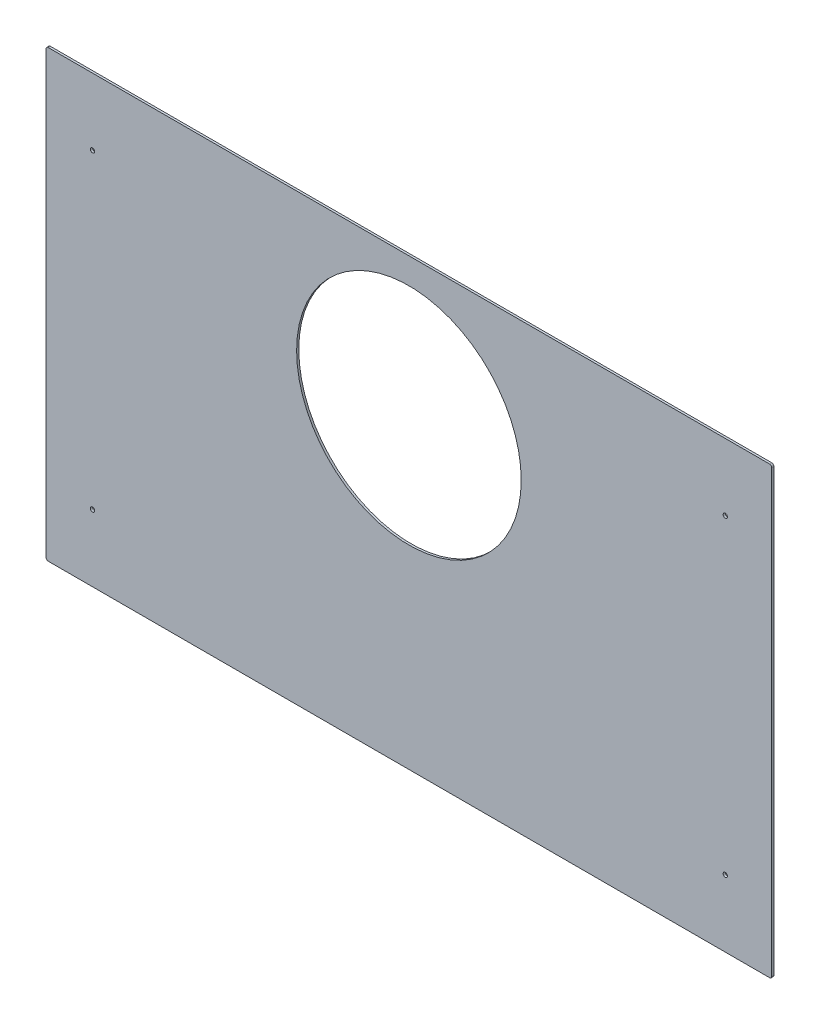
ISO-10303-21;
HEADER;
FILE_DESCRIPTION(('STEP AP214'),'2;1');
FILE_NAME('part.step','',(''),(''),'','','');
FILE_SCHEMA(('AUTOMOTIVE_DESIGN { 1 0 10303 214 1 1 1 1 }'));
ENDSEC;
DATA;
#1=APPLICATION_CONTEXT('core data for automotive mechanical design processes');
#2=APPLICATION_PROTOCOL_DEFINITION('international standard','automotive_design',2000,#1);
#3=PRODUCT_CONTEXT('',#1,'mechanical');
#4=PRODUCT('Part','Part','',(#3));
#5=PRODUCT_RELATED_PRODUCT_CATEGORY('part','',(#4));
#6=PRODUCT_DEFINITION_FORMATION('','',#4);
#7=PRODUCT_DEFINITION_CONTEXT('part definition',#1,'design');
#8=PRODUCT_DEFINITION('design','',#6,#7);
#9=PRODUCT_DEFINITION_SHAPE('','',#8);
#10=(LENGTH_UNIT() NAMED_UNIT(*) SI_UNIT(.MILLI.,.METRE.));
#11=(NAMED_UNIT(*) PLANE_ANGLE_UNIT() SI_UNIT($,.RADIAN.));
#12=(NAMED_UNIT(*) SI_UNIT($,.STERADIAN.) SOLID_ANGLE_UNIT());
#13=UNCERTAINTY_MEASURE_WITH_UNIT(LENGTH_MEASURE(1.E-05),#10,'distance_accuracy_value','');
#14=(GEOMETRIC_REPRESENTATION_CONTEXT(3) GLOBAL_UNCERTAINTY_ASSIGNED_CONTEXT((#13)) GLOBAL_UNIT_ASSIGNED_CONTEXT((#10,
#11,#12)) REPRESENTATION_CONTEXT('',''));
#15=CARTESIAN_POINT('',(0.,0.,0.));
#16=DIRECTION('',(0.,0.,1.));
#17=DIRECTION('',(1.,0.,0.));
#18=AXIS2_PLACEMENT_3D('',#15,#16,#17);
#19=CARTESIAN_POINT('',(0.,0.,3.175));
#20=DIRECTION('',(0.,0.,-1.));
#21=DIRECTION('',(-1.,0.,0.));
#22=AXIS2_PLACEMENT_3D('',#19,#20,#21);
#23=PLANE('',#22);
#24=CARTESIAN_POINT('',(998.5375,555.625,3.175));
#25=DIRECTION('',(0.,0.,-1.));
#26=DIRECTION('',(-1.,0.,0.));
#27=AXIS2_PLACEMENT_3D('',#24,#25,#26);
#28=CIRCLE('',#27,3.17500000000004);
#29=CARTESIAN_POINT('',(995.3625,555.625,3.175));
#30=VERTEX_POINT('',#29);
#31=EDGE_CURVE('E201',#30,#30,#28,.T.);
#32=ORIENTED_EDGE('',*,*,#31,.T.);
#33=EDGE_LOOP('',(#32));
#34=FACE_BOUND('',#33,.T.);
#35=CARTESIAN_POINT('',(998.5375,98.4249999999999,3.175));
#36=DIRECTION('',(0.,0.,-1.));
#37=DIRECTION('',(-1.,0.,0.));
#38=AXIS2_PLACEMENT_3D('',#35,#36,#37);
#39=CIRCLE('',#38,3.17500000000004);
#40=CARTESIAN_POINT('',(995.3625,98.4249999999999,3.175));
#41=VERTEX_POINT('',#40);
#42=EDGE_CURVE('E195',#41,#41,#39,.T.);
#43=ORIENTED_EDGE('',*,*,#42,.T.);
#44=EDGE_LOOP('',(#43));
#45=FACE_BOUND('',#44,.T.);
#46=CARTESIAN_POINT('',(68.2625000000001,98.425,3.175));
#47=DIRECTION('',(0.,0.,-1.));
#48=DIRECTION('',(-1.,0.,0.));
#49=AXIS2_PLACEMENT_3D('',#46,#47,#48);
#50=CIRCLE('',#49,3.175);
#51=CARTESIAN_POINT('',(65.0875000000001,98.425,3.175));
#52=VERTEX_POINT('',#51);
#53=EDGE_CURVE('E189',#52,#52,#50,.T.);
#54=ORIENTED_EDGE('',*,*,#53,.T.);
#55=EDGE_LOOP('',(#54));
#56=FACE_BOUND('',#55,.T.);
#57=CARTESIAN_POINT('',(68.2625000000002,555.625,3.175));
#58=DIRECTION('',(0.,0.,-1.));
#59=DIRECTION('',(-1.,0.,0.));
#60=AXIS2_PLACEMENT_3D('',#57,#58,#59);
#61=CIRCLE('',#60,3.175);
#62=CARTESIAN_POINT('',(65.0875000000002,555.625,3.175));
#63=VERTEX_POINT('',#62);
#64=EDGE_CURVE('E182',#63,#63,#61,.T.);
#65=ORIENTED_EDGE('',*,*,#64,.T.);
#66=EDGE_LOOP('',(#65));
#67=FACE_BOUND('',#66,.T.);
#68=DIRECTION('',(-1.,0.,0.));
#69=VECTOR('',#68,1.);
#70=CARTESIAN_POINT('',(0.,654.05,3.175));
#71=LINE('',#70,#69);
#72=CARTESIAN_POINT('',(1063.625,654.05,3.175));
#73=VERTEX_POINT('',#72);
#74=CARTESIAN_POINT('',(3.175,654.05,3.175));
#75=VERTEX_POINT('',#74);
#76=EDGE_CURVE('E137',#73,#75,#71,.T.);
#77=ORIENTED_EDGE('',*,*,#76,.T.);
#78=CARTESIAN_POINT('',(3.175,650.875,3.175));
#79=DIRECTION('',(0.,0.,-1.));
#80=DIRECTION('',(-1.,0.,0.));
#81=AXIS2_PLACEMENT_3D('',#78,#79,#80);
#82=CIRCLE('',#81,3.175);
#83=CARTESIAN_POINT('',(0.,650.875,3.175));
#84=VERTEX_POINT('',#83);
#85=EDGE_CURVE('E156',#75,#84,#82,.F.);
#86=ORIENTED_EDGE('',*,*,#85,.T.);
#87=DIRECTION('',(0.,-1.,0.));
#88=VECTOR('',#87,1.);
#89=CARTESIAN_POINT('',(0.,0.,3.175));
#90=LINE('',#89,#88);
#91=CARTESIAN_POINT('',(0.,3.175,3.175));
#92=VERTEX_POINT('',#91);
#93=EDGE_CURVE('E120',#84,#92,#90,.T.);
#94=ORIENTED_EDGE('',*,*,#93,.T.);
#95=CARTESIAN_POINT('',(3.175,3.175,3.175));
#96=DIRECTION('',(0.,0.,-1.));
#97=DIRECTION('',(-1.,0.,0.));
#98=AXIS2_PLACEMENT_3D('',#95,#96,#97);
#99=CIRCLE('',#98,3.175);
#100=CARTESIAN_POINT('',(3.175,0.,3.175));
#101=VERTEX_POINT('',#100);
#102=EDGE_CURVE('E154',#92,#101,#99,.F.);
#103=ORIENTED_EDGE('',*,*,#102,.T.);
#104=DIRECTION('',(1.,0.,0.));
#105=VECTOR('',#104,1.);
#106=CARTESIAN_POINT('',(0.,0.,3.175));
#107=LINE('',#106,#105);
#108=CARTESIAN_POINT('',(1063.625,0.,3.175));
#109=VERTEX_POINT('',#108);
#110=EDGE_CURVE('E167',#101,#109,#107,.T.);
#111=ORIENTED_EDGE('',*,*,#110,.T.);
#112=CARTESIAN_POINT('',(1063.625,3.175,3.175));
#113=DIRECTION('',(0.,0.,-1.));
#114=DIRECTION('',(-1.,0.,0.));
#115=AXIS2_PLACEMENT_3D('',#112,#113,#114);
#116=CIRCLE('',#115,3.175);
#117=CARTESIAN_POINT('',(1066.8,3.175,3.175));
#118=VERTEX_POINT('',#117);
#119=EDGE_CURVE('E55',#109,#118,#116,.F.);
#120=ORIENTED_EDGE('',*,*,#119,.T.);
#121=DIRECTION('',(0.,1.,0.));
#122=VECTOR('',#121,1.);
#123=CARTESIAN_POINT('',(1066.8,0.,3.175));
#124=LINE('',#123,#122);
#125=CARTESIAN_POINT('',(1066.8,650.875,3.175));
#126=VERTEX_POINT('',#125);
#127=EDGE_CURVE('E175',#118,#126,#124,.T.);
#128=ORIENTED_EDGE('',*,*,#127,.T.);
#129=CARTESIAN_POINT('',(1063.625,650.875,3.175));
#130=DIRECTION('',(0.,0.,-1.));
#131=DIRECTION('',(-1.,0.,0.));
#132=AXIS2_PLACEMENT_3D('',#129,#130,#131);
#133=CIRCLE('',#132,3.175);
#134=EDGE_CURVE('E151',#126,#73,#133,.F.);
#135=ORIENTED_EDGE('',*,*,#134,.T.);
#136=EDGE_LOOP('',(#77,#86,#94,#103,#111,#120,#128,#135));
#137=FACE_BOUND('',#136,.T.);
#138=CARTESIAN_POINT('',(533.4,450.85,3.175));
#139=DIRECTION('',(0.,0.,1.));
#140=DIRECTION('',(1.,0.,0.));
#141=AXIS2_PLACEMENT_3D('',#138,#139,#140);
#142=CIRCLE('',#141,165.1);
#143=CARTESIAN_POINT('',(698.5,450.85,3.175));
#144=VERTEX_POINT('',#143);
#145=EDGE_CURVE('E128',#144,#144,#142,.T.);
#146=ORIENTED_EDGE('',*,*,#145,.F.);
#147=EDGE_LOOP('',(#146));
#148=FACE_BOUND('',#147,.T.);
#149=ADVANCED_FACE('F34',(#34,#45,#56,#67,#137,#148),#23,.F.);
#150=CARTESIAN_POINT('',(0.,0.,0.));
#151=DIRECTION('',(0.,0.,-1.));
#152=DIRECTION('',(-1.,0.,0.));
#153=AXIS2_PLACEMENT_3D('',#150,#151,#152);
#154=PLANE('',#153);
#155=CARTESIAN_POINT('',(998.5375,555.625,0.));
#156=DIRECTION('',(0.,0.,-1.));
#157=DIRECTION('',(-1.,0.,0.));
#158=AXIS2_PLACEMENT_3D('',#155,#156,#157);
#159=CIRCLE('',#158,3.17500000000004);
#160=CARTESIAN_POINT('',(995.3625,555.625,0.));
#161=VERTEX_POINT('',#160);
#162=EDGE_CURVE('E204',#161,#161,#159,.T.);
#163=ORIENTED_EDGE('',*,*,#162,.F.);
#164=EDGE_LOOP('',(#163));
#165=FACE_BOUND('',#164,.T.);
#166=CARTESIAN_POINT('',(998.5375,98.4249999999999,0.));
#167=DIRECTION('',(0.,0.,-1.));
#168=DIRECTION('',(-1.,0.,0.));
#169=AXIS2_PLACEMENT_3D('',#166,#167,#168);
#170=CIRCLE('',#169,3.17500000000004);
#171=CARTESIAN_POINT('',(995.3625,98.4249999999999,0.));
#172=VERTEX_POINT('',#171);
#173=EDGE_CURVE('E198',#172,#172,#170,.T.);
#174=ORIENTED_EDGE('',*,*,#173,.F.);
#175=EDGE_LOOP('',(#174));
#176=FACE_BOUND('',#175,.T.);
#177=CARTESIAN_POINT('',(68.2625000000001,98.425,0.));
#178=DIRECTION('',(0.,0.,-1.));
#179=DIRECTION('',(-1.,0.,0.));
#180=AXIS2_PLACEMENT_3D('',#177,#178,#179);
#181=CIRCLE('',#180,3.17499999999998);
#182=CARTESIAN_POINT('',(65.0875000000001,98.425,0.));
#183=VERTEX_POINT('',#182);
#184=EDGE_CURVE('E192',#183,#183,#181,.T.);
#185=ORIENTED_EDGE('',*,*,#184,.F.);
#186=EDGE_LOOP('',(#185));
#187=FACE_BOUND('',#186,.T.);
#188=CARTESIAN_POINT('',(68.2625000000002,555.625,0.));
#189=DIRECTION('',(0.,0.,-1.));
#190=DIRECTION('',(-1.,0.,0.));
#191=AXIS2_PLACEMENT_3D('',#188,#189,#190);
#192=CIRCLE('',#191,3.17499999999998);
#193=CARTESIAN_POINT('',(65.0875000000002,555.625,0.));
#194=VERTEX_POINT('',#193);
#195=EDGE_CURVE('E186',#194,#194,#192,.T.);
#196=ORIENTED_EDGE('',*,*,#195,.F.);
#197=EDGE_LOOP('',(#196));
#198=FACE_BOUND('',#197,.T.);
#199=DIRECTION('',(0.,-1.,0.));
#200=VECTOR('',#199,1.);
#201=CARTESIAN_POINT('',(0.,0.,0.));
#202=LINE('',#201,#200);
#203=CARTESIAN_POINT('',(0.,650.875,0.));
#204=VERTEX_POINT('',#203);
#205=CARTESIAN_POINT('',(0.,3.175,0.));
#206=VERTEX_POINT('',#205);
#207=EDGE_CURVE('E117',#204,#206,#202,.T.);
#208=ORIENTED_EDGE('',*,*,#207,.F.);
#209=CARTESIAN_POINT('',(3.175,650.875,0.));
#210=DIRECTION('',(0.,0.,-1.));
#211=DIRECTION('',(-1.,0.,0.));
#212=AXIS2_PLACEMENT_3D('',#209,#210,#211);
#213=CIRCLE('',#212,3.175);
#214=CARTESIAN_POINT('',(3.175,654.05,0.));
#215=VERTEX_POINT('',#214);
#216=EDGE_CURVE('E100',#204,#215,#213,.T.);
#217=ORIENTED_EDGE('',*,*,#216,.T.);
#218=DIRECTION('',(-1.,0.,0.));
#219=VECTOR('',#218,1.);
#220=CARTESIAN_POINT('',(0.,654.05,0.));
#221=LINE('',#220,#219);
#222=CARTESIAN_POINT('',(1063.625,654.05,0.));
#223=VERTEX_POINT('',#222);
#224=EDGE_CURVE('E141',#223,#215,#221,.T.);
#225=ORIENTED_EDGE('',*,*,#224,.F.);
#226=CARTESIAN_POINT('',(1063.625,650.875,0.));
#227=DIRECTION('',(0.,0.,-1.));
#228=DIRECTION('',(-1.,0.,0.));
#229=AXIS2_PLACEMENT_3D('',#226,#227,#228);
#230=CIRCLE('',#229,3.175);
#231=CARTESIAN_POINT('',(1066.8,650.875,0.));
#232=VERTEX_POINT('',#231);
#233=EDGE_CURVE('E121',#223,#232,#230,.T.);
#234=ORIENTED_EDGE('',*,*,#233,.T.);
#235=DIRECTION('',(0.,1.,0.));
#236=VECTOR('',#235,1.);
#237=CARTESIAN_POINT('',(1066.8,0.,0.));
#238=LINE('',#237,#236);
#239=CARTESIAN_POINT('',(1066.8,3.175,0.));
#240=VERTEX_POINT('',#239);
#241=EDGE_CURVE('E131',#240,#232,#238,.T.);
#242=ORIENTED_EDGE('',*,*,#241,.F.);
#243=CARTESIAN_POINT('',(1063.625,3.175,0.));
#244=DIRECTION('',(0.,0.,-1.));
#245=DIRECTION('',(-1.,0.,0.));
#246=AXIS2_PLACEMENT_3D('',#243,#244,#245);
#247=CIRCLE('',#246,3.175);
#248=CARTESIAN_POINT('',(1063.625,0.,0.));
#249=VERTEX_POINT('',#248);
#250=EDGE_CURVE('E145',#240,#249,#247,.T.);
#251=ORIENTED_EDGE('',*,*,#250,.T.);
#252=DIRECTION('',(1.,0.,0.));
#253=VECTOR('',#252,1.);
#254=CARTESIAN_POINT('',(0.,0.,0.));
#255=LINE('',#254,#253);
#256=CARTESIAN_POINT('',(3.175,0.,0.));
#257=VERTEX_POINT('',#256);
#258=EDGE_CURVE('E127',#257,#249,#255,.T.);
#259=ORIENTED_EDGE('',*,*,#258,.F.);
#260=CARTESIAN_POINT('',(3.175,3.175,0.));
#261=DIRECTION('',(0.,0.,-1.));
#262=DIRECTION('',(-1.,0.,0.));
#263=AXIS2_PLACEMENT_3D('',#260,#261,#262);
#264=CIRCLE('',#263,3.175);
#265=EDGE_CURVE('E111',#257,#206,#264,.T.);
#266=ORIENTED_EDGE('',*,*,#265,.T.);
#267=EDGE_LOOP('',(#208,#217,#225,#234,#242,#251,#259,#266));
#268=FACE_BOUND('',#267,.T.);
#269=CARTESIAN_POINT('',(533.4,450.85,0.));
#270=DIRECTION('',(0.,0.,1.));
#271=DIRECTION('',(1.,0.,0.));
#272=AXIS2_PLACEMENT_3D('',#269,#270,#271);
#273=CIRCLE('',#272,165.1);
#274=CARTESIAN_POINT('',(698.5,450.85,0.));
#275=VERTEX_POINT('',#274);
#276=EDGE_CURVE('E134',#275,#275,#273,.T.);
#277=ORIENTED_EDGE('',*,*,#276,.T.);
#278=EDGE_LOOP('',(#277));
#279=FACE_BOUND('',#278,.T.);
#280=ADVANCED_FACE('F124',(#165,#176,#187,#198,#268,#279),#154,.T.);
#281=CARTESIAN_POINT('',(0.,0.,3.175));
#282=DIRECTION('',(1.,0.,0.));
#283=DIRECTION('',(0.,0.,-1.));
#284=AXIS2_PLACEMENT_3D('',#281,#282,#283);
#285=PLANE('',#284);
#286=ORIENTED_EDGE('',*,*,#93,.F.);
#287=DIRECTION('',(0.,0.,-1.));
#288=VECTOR('',#287,1.);
#289=CARTESIAN_POINT('',(0.,650.875,3.175));
#290=LINE('',#289,#288);
#291=EDGE_CURVE('E104',#84,#204,#290,.T.);
#292=ORIENTED_EDGE('',*,*,#291,.T.);
#293=ORIENTED_EDGE('',*,*,#207,.T.);
#294=DIRECTION('',(0.,0.,-1.));
#295=VECTOR('',#294,1.);
#296=CARTESIAN_POINT('',(0.,3.175,3.175));
#297=LINE('',#296,#295);
#298=EDGE_CURVE('E122',#206,#92,#297,.F.);
#299=ORIENTED_EDGE('',*,*,#298,.T.);
#300=EDGE_LOOP('',(#286,#292,#293,#299));
#301=FACE_BOUND('',#300,.T.);
#302=ADVANCED_FACE('F116',(#301),#285,.F.);
#303=CARTESIAN_POINT('',(0.,0.,3.175));
#304=DIRECTION('',(0.,1.,0.));
#305=DIRECTION('',(0.,0.,1.));
#306=AXIS2_PLACEMENT_3D('',#303,#304,#305);
#307=PLANE('',#306);
#308=ORIENTED_EDGE('',*,*,#110,.F.);
#309=DIRECTION('',(0.,0.,-1.));
#310=VECTOR('',#309,1.);
#311=CARTESIAN_POINT('',(3.175,0.,3.175));
#312=LINE('',#311,#310);
#313=EDGE_CURVE('E160',#101,#257,#312,.T.);
#314=ORIENTED_EDGE('',*,*,#313,.T.);
#315=ORIENTED_EDGE('',*,*,#258,.T.);
#316=DIRECTION('',(0.,0.,-1.));
#317=VECTOR('',#316,1.);
#318=CARTESIAN_POINT('',(1063.625,0.,3.175));
#319=LINE('',#318,#317);
#320=EDGE_CURVE('E158',#249,#109,#319,.F.);
#321=ORIENTED_EDGE('',*,*,#320,.T.);
#322=EDGE_LOOP('',(#308,#314,#315,#321));
#323=FACE_BOUND('',#322,.T.);
#324=ADVANCED_FACE('F165',(#323),#307,.F.);
#325=CARTESIAN_POINT('',(1066.8,0.,3.175));
#326=DIRECTION('',(-1.,0.,0.));
#327=DIRECTION('',(0.,0.,1.));
#328=AXIS2_PLACEMENT_3D('',#325,#326,#327);
#329=PLANE('',#328);
#330=ORIENTED_EDGE('',*,*,#127,.F.);
#331=DIRECTION('',(0.,0.,-1.));
#332=VECTOR('',#331,1.);
#333=CARTESIAN_POINT('',(1066.8,3.175,3.175));
#334=LINE('',#333,#332);
#335=EDGE_CURVE('E11',#118,#240,#334,.T.);
#336=ORIENTED_EDGE('',*,*,#335,.T.);
#337=ORIENTED_EDGE('',*,*,#241,.T.);
#338=DIRECTION('',(0.,0.,-1.));
#339=VECTOR('',#338,1.);
#340=CARTESIAN_POINT('',(1066.8,650.875,3.175));
#341=LINE('',#340,#339);
#342=EDGE_CURVE('E42',#232,#126,#341,.F.);
#343=ORIENTED_EDGE('',*,*,#342,.T.);
#344=EDGE_LOOP('',(#330,#336,#337,#343));
#345=FACE_BOUND('',#344,.T.);
#346=ADVANCED_FACE('F174',(#345),#329,.F.);
#347=CARTESIAN_POINT('',(0.,654.05,3.175));
#348=DIRECTION('',(0.,-1.,0.));
#349=DIRECTION('',(0.,0.,-1.));
#350=AXIS2_PLACEMENT_3D('',#347,#348,#349);
#351=PLANE('',#350);
#352=ORIENTED_EDGE('',*,*,#224,.T.);
#353=DIRECTION('',(0.,0.,-1.));
#354=VECTOR('',#353,1.);
#355=CARTESIAN_POINT('',(3.175,654.05,3.175));
#356=LINE('',#355,#354);
#357=EDGE_CURVE('E105',#215,#75,#356,.F.);
#358=ORIENTED_EDGE('',*,*,#357,.T.);
#359=ORIENTED_EDGE('',*,*,#76,.F.);
#360=DIRECTION('',(0.,0.,-1.));
#361=VECTOR('',#360,1.);
#362=CARTESIAN_POINT('',(1063.625,654.05,3.175));
#363=LINE('',#362,#361);
#364=EDGE_CURVE('E110',#73,#223,#363,.T.);
#365=ORIENTED_EDGE('',*,*,#364,.T.);
#366=EDGE_LOOP('',(#352,#358,#359,#365));
#367=FACE_BOUND('',#366,.T.);
#368=ADVANCED_FACE('F232',(#367),#351,.F.);
#369=CARTESIAN_POINT('',(533.4,450.85,3.175));
#370=DIRECTION('',(0.,0.,-1.));
#371=DIRECTION('',(-1.,0.,0.));
#372=AXIS2_PLACEMENT_3D('',#369,#370,#371);
#373=CYLINDRICAL_SURFACE('',#372,165.1);
#374=ORIENTED_EDGE('',*,*,#145,.T.);
#375=EDGE_LOOP('',(#374));
#376=FACE_BOUND('',#375,.T.);
#377=ORIENTED_EDGE('',*,*,#276,.F.);
#378=EDGE_LOOP('',(#377));
#379=FACE_BOUND('',#378,.T.);
#380=ADVANCED_FACE('F222',(#376,#379),#373,.F.);
#381=CARTESIAN_POINT('',(68.2625000000002,555.625,0.));
#382=DIRECTION('',(0.,0.,-1.));
#383=DIRECTION('',(-1.,0.,0.));
#384=AXIS2_PLACEMENT_3D('',#381,#382,#383);
#385=CYLINDRICAL_SURFACE('',#384,3.17499999999999);
#386=ORIENTED_EDGE('',*,*,#64,.F.);
#387=EDGE_LOOP('',(#386));
#388=FACE_BOUND('',#387,.T.);
#389=ORIENTED_EDGE('',*,*,#195,.T.);
#390=EDGE_LOOP('',(#389));
#391=FACE_BOUND('',#390,.T.);
#392=ADVANCED_FACE('F219',(#388,#391),#385,.F.);
#393=CARTESIAN_POINT('',(68.2625000000001,98.425,0.));
#394=DIRECTION('',(0.,0.,-1.));
#395=DIRECTION('',(-1.,0.,0.));
#396=AXIS2_PLACEMENT_3D('',#393,#394,#395);
#397=CYLINDRICAL_SURFACE('',#396,3.17499999999999);
#398=ORIENTED_EDGE('',*,*,#53,.F.);
#399=EDGE_LOOP('',(#398));
#400=FACE_BOUND('',#399,.T.);
#401=ORIENTED_EDGE('',*,*,#184,.T.);
#402=EDGE_LOOP('',(#401));
#403=FACE_BOUND('',#402,.T.);
#404=ADVANCED_FACE('F221',(#400,#403),#397,.F.);
#405=CARTESIAN_POINT('',(998.5375,98.4249999999999,0.));
#406=DIRECTION('',(0.,0.,-1.));
#407=DIRECTION('',(-1.,0.,0.));
#408=AXIS2_PLACEMENT_3D('',#405,#406,#407);
#409=CYLINDRICAL_SURFACE('',#408,3.17500000000004);
#410=ORIENTED_EDGE('',*,*,#42,.F.);
#411=EDGE_LOOP('',(#410));
#412=FACE_BOUND('',#411,.T.);
#413=ORIENTED_EDGE('',*,*,#173,.T.);
#414=EDGE_LOOP('',(#413));
#415=FACE_BOUND('',#414,.T.);
#416=ADVANCED_FACE('F229',(#412,#415),#409,.F.);
#417=CARTESIAN_POINT('',(998.5375,555.625,0.));
#418=DIRECTION('',(0.,0.,-1.));
#419=DIRECTION('',(-1.,0.,0.));
#420=AXIS2_PLACEMENT_3D('',#417,#418,#419);
#421=CYLINDRICAL_SURFACE('',#420,3.17500000000004);
#422=ORIENTED_EDGE('',*,*,#31,.F.);
#423=EDGE_LOOP('',(#422));
#424=FACE_BOUND('',#423,.T.);
#425=ORIENTED_EDGE('',*,*,#162,.T.);
#426=EDGE_LOOP('',(#425));
#427=FACE_BOUND('',#426,.T.);
#428=ADVANCED_FACE('F208',(#424,#427),#421,.F.);
#429=CARTESIAN_POINT('',(3.175,650.875,3.175));
#430=DIRECTION('',(0.,0.,-1.));
#431=DIRECTION('',(-1.,0.,0.));
#432=AXIS2_PLACEMENT_3D('',#429,#430,#431);
#433=CYLINDRICAL_SURFACE('',#432,3.175);
#434=ORIENTED_EDGE('',*,*,#85,.F.);
#435=ORIENTED_EDGE('',*,*,#357,.F.);
#436=ORIENTED_EDGE('',*,*,#216,.F.);
#437=ORIENTED_EDGE('',*,*,#291,.F.);
#438=EDGE_LOOP('',(#434,#435,#436,#437));
#439=FACE_BOUND('',#438,.T.);
#440=ADVANCED_FACE('F103',(#439),#433,.T.);
#441=CARTESIAN_POINT('',(3.175,3.175,3.175));
#442=DIRECTION('',(0.,0.,-1.));
#443=DIRECTION('',(-1.,0.,0.));
#444=AXIS2_PLACEMENT_3D('',#441,#442,#443);
#445=CYLINDRICAL_SURFACE('',#444,3.175);
#446=ORIENTED_EDGE('',*,*,#102,.F.);
#447=ORIENTED_EDGE('',*,*,#298,.F.);
#448=ORIENTED_EDGE('',*,*,#265,.F.);
#449=ORIENTED_EDGE('',*,*,#313,.F.);
#450=EDGE_LOOP('',(#446,#447,#448,#449));
#451=FACE_BOUND('',#450,.T.);
#452=ADVANCED_FACE('F254',(#451),#445,.T.);
#453=CARTESIAN_POINT('',(1063.625,3.175,3.175));
#454=DIRECTION('',(0.,0.,-1.));
#455=DIRECTION('',(-1.,0.,0.));
#456=AXIS2_PLACEMENT_3D('',#453,#454,#455);
#457=CYLINDRICAL_SURFACE('',#456,3.175);
#458=ORIENTED_EDGE('',*,*,#119,.F.);
#459=ORIENTED_EDGE('',*,*,#320,.F.);
#460=ORIENTED_EDGE('',*,*,#250,.F.);
#461=ORIENTED_EDGE('',*,*,#335,.F.);
#462=EDGE_LOOP('',(#458,#459,#460,#461));
#463=FACE_BOUND('',#462,.T.);
#464=ADVANCED_FACE('F173',(#463),#457,.T.);
#465=CARTESIAN_POINT('',(1063.625,650.875,3.175));
#466=DIRECTION('',(0.,0.,-1.));
#467=DIRECTION('',(-1.,0.,0.));
#468=AXIS2_PLACEMENT_3D('',#465,#466,#467);
#469=CYLINDRICAL_SURFACE('',#468,3.175);
#470=ORIENTED_EDGE('',*,*,#134,.F.);
#471=ORIENTED_EDGE('',*,*,#342,.F.);
#472=ORIENTED_EDGE('',*,*,#233,.F.);
#473=ORIENTED_EDGE('',*,*,#364,.F.);
#474=EDGE_LOOP('',(#470,#471,#472,#473));
#475=FACE_BOUND('',#474,.T.);
#476=ADVANCED_FACE('F36',(#475),#469,.T.);
#477=CLOSED_SHELL('',(#149,#280,#302,#324,#346,#368,#380,#392,#404,#416,#428,#440,#452,#464,#476));
#478=MANIFOLD_SOLID_BREP('B2',#477);
#479=ADVANCED_BREP_SHAPE_REPRESENTATION('',(#18,#478),#14);
#480=SHAPE_DEFINITION_REPRESENTATION(#9,#479);
ENDSEC;
END-ISO-10303-21;
